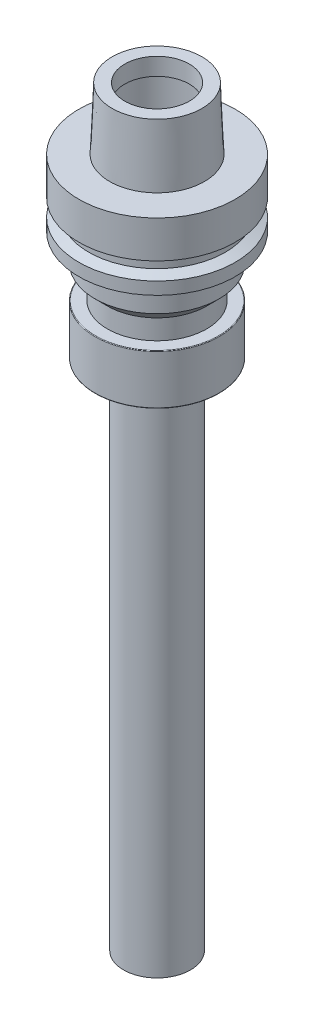
ISO-10303-21;
HEADER;
FILE_DESCRIPTION(('STEP AP214'),'2;1');
FILE_NAME('part.step','',(''),(''),'','','');
FILE_SCHEMA(('AUTOMOTIVE_DESIGN { 1 0 10303 214 1 1 1 1 }'));
ENDSEC;
DATA;
#1=APPLICATION_CONTEXT('core data for automotive mechanical design processes');
#2=APPLICATION_PROTOCOL_DEFINITION('international standard','automotive_design',2000,#1);
#3=PRODUCT_CONTEXT('',#1,'mechanical');
#4=PRODUCT('Part','Part','',(#3));
#5=PRODUCT_RELATED_PRODUCT_CATEGORY('part','',(#4));
#6=PRODUCT_DEFINITION_FORMATION('','',#4);
#7=PRODUCT_DEFINITION_CONTEXT('part definition',#1,'design');
#8=PRODUCT_DEFINITION('design','',#6,#7);
#9=PRODUCT_DEFINITION_SHAPE('','',#8);
#10=(LENGTH_UNIT() NAMED_UNIT(*) SI_UNIT(.MILLI.,.METRE.));
#11=(NAMED_UNIT(*) PLANE_ANGLE_UNIT() SI_UNIT($,.RADIAN.));
#12=(NAMED_UNIT(*) SI_UNIT($,.STERADIAN.) SOLID_ANGLE_UNIT());
#13=UNCERTAINTY_MEASURE_WITH_UNIT(LENGTH_MEASURE(1.E-05),#10,'distance_accuracy_value','');
#14=(GEOMETRIC_REPRESENTATION_CONTEXT(3) GLOBAL_UNCERTAINTY_ASSIGNED_CONTEXT((#13)) GLOBAL_UNIT_ASSIGNED_CONTEXT((#10,
#11,#12)) REPRESENTATION_CONTEXT('',''));
#15=CARTESIAN_POINT('',(0.,0.,0.));
#16=DIRECTION('',(0.,0.,1.));
#17=DIRECTION('',(1.,0.,0.));
#18=AXIS2_PLACEMENT_3D('',#15,#16,#17);
#19=CARTESIAN_POINT('',(-13.,64.2999999999999,0.));
#20=DIRECTION('',(0.,-1.,0.));
#21=DIRECTION('',(0.,0.,-1.));
#22=AXIS2_PLACEMENT_3D('',#19,#20,#21);
#23=PLANE('',#22);
#24=CARTESIAN_POINT('',(0.,64.2999999999999,0.));
#25=DIRECTION('',(0.,-1.,0.));
#26=DIRECTION('',(0.,0.,-1.));
#27=AXIS2_PLACEMENT_3D('',#24,#25,#26);
#28=CIRCLE('',#27,13.);
#29=CARTESIAN_POINT('',(0.,64.2999999999999,-13.));
#30=VERTEX_POINT('',#29);
#31=EDGE_CURVE('E47',#30,#30,#28,.T.);
#32=ORIENTED_EDGE('',*,*,#31,.F.);
#33=EDGE_LOOP('',(#32));
#34=FACE_BOUND('',#33,.T.);
#35=ADVANCED_FACE('F39',(#34),#23,.F.);
#36=CARTESIAN_POINT('',(0.,0.,0.));
#37=DIRECTION('',(0.,-1.,0.));
#38=DIRECTION('',(0.,0.,-1.));
#39=AXIS2_PLACEMENT_3D('',#36,#37,#38);
#40=CYLINDRICAL_SURFACE('',#39,13.);
#41=CARTESIAN_POINT('',(0.,69.2999999999999,0.));
#42=DIRECTION('',(0.,-1.,0.));
#43=DIRECTION('',(0.,0.,-1.));
#44=AXIS2_PLACEMENT_3D('',#41,#42,#43);
#45=CIRCLE('',#44,13.);
#46=CARTESIAN_POINT('',(0.,69.2999999999999,-13.));
#47=VERTEX_POINT('',#46);
#48=EDGE_CURVE('E52',#47,#47,#45,.T.);
#49=ORIENTED_EDGE('',*,*,#48,.F.);
#50=EDGE_LOOP('',(#49));
#51=FACE_BOUND('',#50,.T.);
#52=ORIENTED_EDGE('',*,*,#31,.T.);
#53=EDGE_LOOP('',(#52));
#54=FACE_BOUND('',#53,.T.);
#55=ADVANCED_FACE('F174',(#51,#54),#40,.F.);
#56=CARTESIAN_POINT('',(-14.,69.2999999999999,0.));
#57=DIRECTION('',(0.,-1.,0.));
#58=DIRECTION('',(0.,0.,-1.));
#59=AXIS2_PLACEMENT_3D('',#56,#57,#58);
#60=PLANE('',#59);
#61=CARTESIAN_POINT('',(0.,69.2999999999999,0.));
#62=DIRECTION('',(0.,-1.,0.));
#63=DIRECTION('',(0.,0.,-1.));
#64=AXIS2_PLACEMENT_3D('',#61,#62,#63);
#65=CIRCLE('',#64,14.);
#66=CARTESIAN_POINT('',(0.,69.2999999999999,-14.));
#67=VERTEX_POINT('',#66);
#68=EDGE_CURVE('E57',#67,#67,#65,.T.);
#69=ORIENTED_EDGE('',*,*,#68,.F.);
#70=EDGE_LOOP('',(#69));
#71=FACE_BOUND('',#70,.T.);
#72=ORIENTED_EDGE('',*,*,#48,.T.);
#73=EDGE_LOOP('',(#72));
#74=FACE_BOUND('',#73,.T.);
#75=ADVANCED_FACE('F180',(#71,#74),#60,.F.);
#76=CARTESIAN_POINT('',(0.,71.2999999999999,0.));
#77=DIRECTION('',(0.,-1.,0.));
#78=DIRECTION('',(0.,0.,-1.));
#79=AXIS2_PLACEMENT_3D('',#76,#77,#78);
#80=TOROIDAL_SURFACE('',#79,14.,2.);
#81=CARTESIAN_POINT('',(0.,71.2999999999999,0.));
#82=DIRECTION('',(0.,-1.,0.));
#83=DIRECTION('',(0.,0.,-1.));
#84=AXIS2_PLACEMENT_3D('',#81,#82,#83);
#85=CIRCLE('',#84,16.);
#86=CARTESIAN_POINT('',(0.,71.2999999999999,-16.));
#87=VERTEX_POINT('',#86);
#88=EDGE_CURVE('E63',#87,#87,#85,.T.);
#89=ORIENTED_EDGE('',*,*,#88,.F.);
#90=EDGE_LOOP('',(#89));
#91=FACE_BOUND('',#90,.T.);
#92=ORIENTED_EDGE('',*,*,#68,.T.);
#93=EDGE_LOOP('',(#92));
#94=FACE_BOUND('',#93,.T.);
#95=ADVANCED_FACE('F186',(#91,#94),#80,.F.);
#96=CARTESIAN_POINT('',(0.,0.,0.));
#97=DIRECTION('',(0.,-1.,0.));
#98=DIRECTION('',(0.,0.,-1.));
#99=AXIS2_PLACEMENT_3D('',#96,#97,#98);
#100=CYLINDRICAL_SURFACE('',#99,16.);
#101=CARTESIAN_POINT('',(0.,89.2999999999999,0.));
#102=DIRECTION('',(0.,-1.,0.));
#103=DIRECTION('',(0.,0.,-1.));
#104=AXIS2_PLACEMENT_3D('',#101,#102,#103);
#105=CIRCLE('',#104,16.);
#106=CARTESIAN_POINT('',(0.,89.2999999999999,-16.));
#107=VERTEX_POINT('',#106);
#108=EDGE_CURVE('E67',#107,#107,#105,.T.);
#109=ORIENTED_EDGE('',*,*,#108,.F.);
#110=EDGE_LOOP('',(#109));
#111=FACE_BOUND('',#110,.T.);
#112=ORIENTED_EDGE('',*,*,#88,.T.);
#113=EDGE_LOOP('',(#112));
#114=FACE_BOUND('',#113,.T.);
#115=ADVANCED_FACE('F190',(#111,#114),#100,.F.);
#116=CARTESIAN_POINT('',(0.,89.2999999999999,0.));
#117=DIRECTION('',(0.,-1.,0.));
#118=DIRECTION('',(0.,0.,-1.));
#119=AXIS2_PLACEMENT_3D('',#116,#117,#118);
#120=TOROIDAL_SURFACE('',#119,14.,2.);
#121=CARTESIAN_POINT('',(0.,91.2999999999999,0.));
#122=DIRECTION('',(0.,-1.,0.));
#123=DIRECTION('',(0.,0.,-1.));
#124=AXIS2_PLACEMENT_3D('',#121,#122,#123);
#125=CIRCLE('',#124,14.);
#126=CARTESIAN_POINT('',(0.,91.2999999999999,-14.));
#127=VERTEX_POINT('',#126);
#128=EDGE_CURVE('E71',#127,#127,#125,.T.);
#129=ORIENTED_EDGE('',*,*,#128,.F.);
#130=EDGE_LOOP('',(#129));
#131=FACE_BOUND('',#130,.T.);
#132=ORIENTED_EDGE('',*,*,#108,.T.);
#133=EDGE_LOOP('',(#132));
#134=FACE_BOUND('',#133,.T.);
#135=ADVANCED_FACE('F194',(#131,#134),#120,.F.);
#136=CARTESIAN_POINT('',(-13.,91.2999999999999,0.));
#137=DIRECTION('',(0.,1.,0.));
#138=DIRECTION('',(0.,0.,1.));
#139=AXIS2_PLACEMENT_3D('',#136,#137,#138);
#140=PLANE('',#139);
#141=CARTESIAN_POINT('',(0.,91.2999999999999,0.));
#142=DIRECTION('',(0.,-1.,0.));
#143=DIRECTION('',(0.,0.,-1.));
#144=AXIS2_PLACEMENT_3D('',#141,#142,#143);
#145=CIRCLE('',#144,13.);
#146=CARTESIAN_POINT('',(0.,91.2999999999999,-13.));
#147=VERTEX_POINT('',#146);
#148=EDGE_CURVE('E75',#147,#147,#145,.T.);
#149=ORIENTED_EDGE('',*,*,#148,.F.);
#150=EDGE_LOOP('',(#149));
#151=FACE_BOUND('',#150,.T.);
#152=ORIENTED_EDGE('',*,*,#128,.T.);
#153=EDGE_LOOP('',(#152));
#154=FACE_BOUND('',#153,.T.);
#155=ADVANCED_FACE('F198',(#151,#154),#140,.F.);
#156=CARTESIAN_POINT('',(0.,0.,0.));
#157=DIRECTION('',(0.,-1.,0.));
#158=DIRECTION('',(0.,0.,-1.));
#159=AXIS2_PLACEMENT_3D('',#156,#157,#158);
#160=CYLINDRICAL_SURFACE('',#159,13.);
#161=CARTESIAN_POINT('',(0.,98.2999999999999,0.));
#162=DIRECTION('',(0.,-1.,0.));
#163=DIRECTION('',(0.,0.,-1.));
#164=AXIS2_PLACEMENT_3D('',#161,#162,#163);
#165=CIRCLE('',#164,13.);
#166=CARTESIAN_POINT('',(0.,98.2999999999999,-13.));
#167=VERTEX_POINT('',#166);
#168=EDGE_CURVE('E79',#167,#167,#165,.T.);
#169=ORIENTED_EDGE('',*,*,#168,.F.);
#170=EDGE_LOOP('',(#169));
#171=FACE_BOUND('',#170,.T.);
#172=ORIENTED_EDGE('',*,*,#148,.T.);
#173=EDGE_LOOP('',(#172));
#174=FACE_BOUND('',#173,.T.);
#175=ADVANCED_FACE('F202',(#171,#174),#160,.F.);
#176=CARTESIAN_POINT('',(-13.,98.2999999999999,0.));
#177=DIRECTION('',(0.,-1.,0.));
#178=DIRECTION('',(0.,0.,-1.));
#179=AXIS2_PLACEMENT_3D('',#176,#177,#178);
#180=PLANE('',#179);
#181=CARTESIAN_POINT('',(0.,98.2999999999999,0.));
#182=DIRECTION('',(0.,-1.,0.));
#183=DIRECTION('',(0.,0.,-1.));
#184=AXIS2_PLACEMENT_3D('',#181,#182,#183);
#185=CIRCLE('',#184,18.085);
#186=CARTESIAN_POINT('',(0.,98.2999999999999,-18.085));
#187=VERTEX_POINT('',#186);
#188=EDGE_CURVE('E83',#187,#187,#185,.T.);
#189=ORIENTED_EDGE('',*,*,#188,.F.);
#190=EDGE_LOOP('',(#189));
#191=FACE_BOUND('',#190,.T.);
#192=ORIENTED_EDGE('',*,*,#168,.T.);
#193=EDGE_LOOP('',(#192));
#194=FACE_BOUND('',#193,.T.);
#195=ADVANCED_FACE('F206',(#191,#194),#180,.F.);
#196=CARTESIAN_POINT('',(0.,98.2999999999999,0.));
#197=DIRECTION('',(0.,-1.,0.));
#198=DIRECTION('',(0.,0.,-1.));
#199=AXIS2_PLACEMENT_3D('',#196,#197,#198);
#200=CONICAL_SURFACE('',#199,18.085,0.0405777142314997);
#201=CARTESIAN_POINT('',(0.,73.2999999999999,0.));
#202=DIRECTION('',(0.,-1.,0.));
#203=DIRECTION('',(0.,0.,-1.));
#204=AXIS2_PLACEMENT_3D('',#201,#202,#203);
#205=CIRCLE('',#204,19.1);
#206=CARTESIAN_POINT('',(0.,73.2999999999999,-19.1));
#207=VERTEX_POINT('',#206);
#208=EDGE_CURVE('E87',#207,#207,#205,.T.);
#209=ORIENTED_EDGE('',*,*,#208,.F.);
#210=EDGE_LOOP('',(#209));
#211=FACE_BOUND('',#210,.T.);
#212=ORIENTED_EDGE('',*,*,#188,.T.);
#213=EDGE_LOOP('',(#212));
#214=FACE_BOUND('',#213,.T.);
#215=ADVANCED_FACE('F210',(#211,#214),#200,.T.);
#216=CARTESIAN_POINT('',(-19.1,73.2999999999999,0.));
#217=DIRECTION('',(0.,-1.,0.));
#218=DIRECTION('',(0.,0.,-1.));
#219=AXIS2_PLACEMENT_3D('',#216,#217,#218);
#220=PLANE('',#219);
#221=CARTESIAN_POINT('',(0.,73.2999999999999,0.));
#222=DIRECTION('',(0.,-1.,0.));
#223=DIRECTION('',(0.,0.,-1.));
#224=AXIS2_PLACEMENT_3D('',#221,#222,#223);
#225=CIRCLE('',#224,31.5);
#226=CARTESIAN_POINT('',(0.,73.2999999999999,-31.5));
#227=VERTEX_POINT('',#226);
#228=EDGE_CURVE('E91',#227,#227,#225,.T.);
#229=ORIENTED_EDGE('',*,*,#228,.F.);
#230=EDGE_LOOP('',(#229));
#231=FACE_BOUND('',#230,.T.);
#232=ORIENTED_EDGE('',*,*,#208,.T.);
#233=EDGE_LOOP('',(#232));
#234=FACE_BOUND('',#233,.T.);
#235=ADVANCED_FACE('F214',(#231,#234),#220,.F.);
#236=CARTESIAN_POINT('',(0.,0.,0.));
#237=DIRECTION('',(0.,-1.,0.));
#238=DIRECTION('',(0.,0.,-1.));
#239=AXIS2_PLACEMENT_3D('',#236,#237,#238);
#240=CYLINDRICAL_SURFACE('',#239,31.5);
#241=CARTESIAN_POINT('',(0.,58.2999999999999,0.));
#242=DIRECTION('',(0.,-1.,0.));
#243=DIRECTION('',(0.,0.,-1.));
#244=AXIS2_PLACEMENT_3D('',#241,#242,#243);
#245=CIRCLE('',#244,31.5);
#246=CARTESIAN_POINT('',(0.,58.2999999999999,-31.5));
#247=VERTEX_POINT('',#246);
#248=EDGE_CURVE('E95',#247,#247,#245,.T.);
#249=ORIENTED_EDGE('',*,*,#248,.F.);
#250=EDGE_LOOP('',(#249));
#251=FACE_BOUND('',#250,.T.);
#252=ORIENTED_EDGE('',*,*,#228,.T.);
#253=EDGE_LOOP('',(#252));
#254=FACE_BOUND('',#253,.T.);
#255=ADVANCED_FACE('F218',(#251,#254),#240,.T.);
#256=CARTESIAN_POINT('',(0.,58.2999999999999,0.));
#257=DIRECTION('',(0.,1.,0.));
#258=DIRECTION('',(0.,0.,1.));
#259=AXIS2_PLACEMENT_3D('',#256,#257,#258);
#260=CONICAL_SURFACE('',#259,31.5,1.21202565652432);
#261=CARTESIAN_POINT('',(0.,56.7999999999999,0.));
#262=DIRECTION('',(0.,-1.,0.));
#263=DIRECTION('',(0.,0.,-1.));
#264=AXIS2_PLACEMENT_3D('',#261,#262,#263);
#265=CIRCLE('',#264,27.5);
#266=CARTESIAN_POINT('',(0.,56.7999999999999,-27.5));
#267=VERTEX_POINT('',#266);
#268=EDGE_CURVE('E99',#267,#267,#265,.T.);
#269=ORIENTED_EDGE('',*,*,#268,.F.);
#270=EDGE_LOOP('',(#269));
#271=FACE_BOUND('',#270,.T.);
#272=ORIENTED_EDGE('',*,*,#248,.T.);
#273=EDGE_LOOP('',(#272));
#274=FACE_BOUND('',#273,.T.);
#275=ADVANCED_FACE('F222',(#271,#274),#260,.T.);
#276=CARTESIAN_POINT('',(0.,0.,0.));
#277=DIRECTION('',(0.,-1.,0.));
#278=DIRECTION('',(0.,0.,-1.));
#279=AXIS2_PLACEMENT_3D('',#276,#277,#278);
#280=CYLINDRICAL_SURFACE('',#279,27.5);
#281=CARTESIAN_POINT('',(0.,52.7999999999999,0.));
#282=DIRECTION('',(0.,-1.,0.));
#283=DIRECTION('',(0.,0.,-1.));
#284=AXIS2_PLACEMENT_3D('',#281,#282,#283);
#285=CIRCLE('',#284,27.5);
#286=CARTESIAN_POINT('',(0.,52.7999999999999,-27.5));
#287=VERTEX_POINT('',#286);
#288=EDGE_CURVE('E103',#287,#287,#285,.T.);
#289=ORIENTED_EDGE('',*,*,#288,.F.);
#290=EDGE_LOOP('',(#289));
#291=FACE_BOUND('',#290,.T.);
#292=ORIENTED_EDGE('',*,*,#268,.T.);
#293=EDGE_LOOP('',(#292));
#294=FACE_BOUND('',#293,.T.);
#295=ADVANCED_FACE('F226',(#291,#294),#280,.T.);
#296=CARTESIAN_POINT('',(0.,52.7999999999999,0.));
#297=DIRECTION('',(0.,-1.,0.));
#298=DIRECTION('',(0.,0.,-1.));
#299=AXIS2_PLACEMENT_3D('',#296,#297,#298);
#300=CONICAL_SURFACE('',#299,27.5,1.21202565652435);
#301=CARTESIAN_POINT('',(0.,51.3,0.));
#302=DIRECTION('',(0.,-1.,0.));
#303=DIRECTION('',(0.,0.,-1.));
#304=AXIS2_PLACEMENT_3D('',#301,#302,#303);
#305=CIRCLE('',#304,31.5);
#306=CARTESIAN_POINT('',(0.,51.3,-31.5));
#307=VERTEX_POINT('',#306);
#308=EDGE_CURVE('E107',#307,#307,#305,.T.);
#309=ORIENTED_EDGE('',*,*,#308,.F.);
#310=EDGE_LOOP('',(#309));
#311=FACE_BOUND('',#310,.T.);
#312=ORIENTED_EDGE('',*,*,#288,.T.);
#313=EDGE_LOOP('',(#312));
#314=FACE_BOUND('',#313,.T.);
#315=ADVANCED_FACE('F230',(#311,#314),#300,.T.);
#316=CARTESIAN_POINT('',(0.,0.,0.));
#317=DIRECTION('',(0.,-1.,0.));
#318=DIRECTION('',(0.,0.,-1.));
#319=AXIS2_PLACEMENT_3D('',#316,#317,#318);
#320=CYLINDRICAL_SURFACE('',#319,31.5);
#321=CARTESIAN_POINT('',(0.,46.3,0.));
#322=DIRECTION('',(0.,-1.,0.));
#323=DIRECTION('',(0.,0.,-1.));
#324=AXIS2_PLACEMENT_3D('',#321,#322,#323);
#325=CIRCLE('',#324,31.5);
#326=CARTESIAN_POINT('',(0.,46.3,-31.5));
#327=VERTEX_POINT('',#326);
#328=EDGE_CURVE('E111',#327,#327,#325,.T.);
#329=ORIENTED_EDGE('',*,*,#328,.F.);
#330=EDGE_LOOP('',(#329));
#331=FACE_BOUND('',#330,.T.);
#332=ORIENTED_EDGE('',*,*,#308,.T.);
#333=EDGE_LOOP('',(#332));
#334=FACE_BOUND('',#333,.T.);
#335=ADVANCED_FACE('F234',(#331,#334),#320,.T.);
#336=CARTESIAN_POINT('',(-31.5,46.3,0.));
#337=DIRECTION('',(0.,1.,0.));
#338=DIRECTION('',(0.,0.,1.));
#339=AXIS2_PLACEMENT_3D('',#336,#337,#338);
#340=PLANE('',#339);
#341=CARTESIAN_POINT('',(0.,46.3,0.));
#342=DIRECTION('',(0.,-1.,0.));
#343=DIRECTION('',(0.,0.,-1.));
#344=AXIS2_PLACEMENT_3D('',#341,#342,#343);
#345=CIRCLE('',#344,25.);
#346=CARTESIAN_POINT('',(0.,46.3,-25.));
#347=VERTEX_POINT('',#346);
#348=EDGE_CURVE('E115',#347,#347,#345,.T.);
#349=ORIENTED_EDGE('',*,*,#348,.F.);
#350=EDGE_LOOP('',(#349));
#351=FACE_BOUND('',#350,.T.);
#352=ORIENTED_EDGE('',*,*,#328,.T.);
#353=EDGE_LOOP('',(#352));
#354=FACE_BOUND('',#353,.T.);
#355=ADVANCED_FACE('F238',(#351,#354),#340,.F.);
#356=CARTESIAN_POINT('',(0.,0.,0.));
#357=DIRECTION('',(0.,-1.,0.));
#358=DIRECTION('',(0.,0.,-1.));
#359=AXIS2_PLACEMENT_3D('',#356,#357,#358);
#360=CYLINDRICAL_SURFACE('',#359,25.);
#361=CARTESIAN_POINT('',(0.,35.3,0.));
#362=DIRECTION('',(0.,-1.,0.));
#363=DIRECTION('',(0.,0.,-1.));
#364=AXIS2_PLACEMENT_3D('',#361,#362,#363);
#365=CIRCLE('',#364,25.);
#366=CARTESIAN_POINT('',(0.,35.3,-25.));
#367=VERTEX_POINT('',#366);
#368=EDGE_CURVE('E119',#367,#367,#365,.T.);
#369=ORIENTED_EDGE('',*,*,#368,.F.);
#370=EDGE_LOOP('',(#369));
#371=FACE_BOUND('',#370,.T.);
#372=ORIENTED_EDGE('',*,*,#348,.T.);
#373=EDGE_LOOP('',(#372));
#374=FACE_BOUND('',#373,.T.);
#375=ADVANCED_FACE('F242',(#371,#374),#360,.T.);
#376=CARTESIAN_POINT('',(0.,35.3,0.));
#377=DIRECTION('',(0.,1.,0.));
#378=DIRECTION('',(0.,0.,1.));
#379=AXIS2_PLACEMENT_3D('',#376,#377,#378);
#380=CONICAL_SURFACE('',#379,25.,0.785398163397451);
#381=CARTESIAN_POINT('',(0.,30.3,0.));
#382=DIRECTION('',(0.,-1.,0.));
#383=DIRECTION('',(0.,0.,-1.));
#384=AXIS2_PLACEMENT_3D('',#381,#382,#383);
#385=CIRCLE('',#384,20.);
#386=CARTESIAN_POINT('',(0.,30.3,-20.));
#387=VERTEX_POINT('',#386);
#388=EDGE_CURVE('E123',#387,#387,#385,.T.);
#389=ORIENTED_EDGE('',*,*,#388,.F.);
#390=EDGE_LOOP('',(#389));
#391=FACE_BOUND('',#390,.T.);
#392=ORIENTED_EDGE('',*,*,#368,.T.);
#393=EDGE_LOOP('',(#392));
#394=FACE_BOUND('',#393,.T.);
#395=ADVANCED_FACE('F246',(#391,#394),#380,.T.);
#396=CARTESIAN_POINT('',(0.,0.,0.));
#397=DIRECTION('',(0.,-1.,0.));
#398=DIRECTION('',(0.,0.,-1.));
#399=AXIS2_PLACEMENT_3D('',#396,#397,#398);
#400=CYLINDRICAL_SURFACE('',#399,20.);
#401=CARTESIAN_POINT('',(0.,22.3,0.));
#402=DIRECTION('',(0.,-1.,0.));
#403=DIRECTION('',(0.,0.,-1.));
#404=AXIS2_PLACEMENT_3D('',#401,#402,#403);
#405=CIRCLE('',#404,20.);
#406=CARTESIAN_POINT('',(0.,22.3,-20.));
#407=VERTEX_POINT('',#406);
#408=EDGE_CURVE('E127',#407,#407,#405,.T.);
#409=ORIENTED_EDGE('',*,*,#408,.F.);
#410=EDGE_LOOP('',(#409));
#411=FACE_BOUND('',#410,.T.);
#412=ORIENTED_EDGE('',*,*,#388,.T.);
#413=EDGE_LOOP('',(#412));
#414=FACE_BOUND('',#413,.T.);
#415=ADVANCED_FACE('F250',(#411,#414),#400,.T.);
#416=CARTESIAN_POINT('',(-20.,22.3,0.));
#417=DIRECTION('',(0.,-1.,0.));
#418=DIRECTION('',(0.,0.,-1.));
#419=AXIS2_PLACEMENT_3D('',#416,#417,#418);
#420=PLANE('',#419);
#421=CARTESIAN_POINT('',(0.,22.3,0.));
#422=DIRECTION('',(0.,-1.,0.));
#423=DIRECTION('',(0.,0.,-1.));
#424=AXIS2_PLACEMENT_3D('',#421,#422,#423);
#425=CIRCLE('',#424,24.75);
#426=CARTESIAN_POINT('',(0.,22.3,-24.75));
#427=VERTEX_POINT('',#426);
#428=EDGE_CURVE('E131',#427,#427,#425,.T.);
#429=ORIENTED_EDGE('',*,*,#428,.F.);
#430=EDGE_LOOP('',(#429));
#431=FACE_BOUND('',#430,.T.);
#432=ORIENTED_EDGE('',*,*,#408,.T.);
#433=EDGE_LOOP('',(#432));
#434=FACE_BOUND('',#433,.T.);
#435=ADVANCED_FACE('F254',(#431,#434),#420,.F.);
#436=CARTESIAN_POINT('',(0.,22.05,0.));
#437=DIRECTION('',(0.,-1.,0.));
#438=DIRECTION('',(0.,0.,-1.));
#439=AXIS2_PLACEMENT_3D('',#436,#437,#438);
#440=TOROIDAL_SURFACE('',#439,24.75,0.25);
#441=CARTESIAN_POINT('',(0.,22.05,0.));
#442=DIRECTION('',(0.,-1.,0.));
#443=DIRECTION('',(0.,0.,-1.));
#444=AXIS2_PLACEMENT_3D('',#441,#442,#443);
#445=CIRCLE('',#444,25.);
#446=CARTESIAN_POINT('',(0.,22.05,-25.));
#447=VERTEX_POINT('',#446);
#448=EDGE_CURVE('E135',#447,#447,#445,.T.);
#449=ORIENTED_EDGE('',*,*,#448,.F.);
#450=EDGE_LOOP('',(#449));
#451=FACE_BOUND('',#450,.T.);
#452=ORIENTED_EDGE('',*,*,#428,.T.);
#453=EDGE_LOOP('',(#452));
#454=FACE_BOUND('',#453,.T.);
#455=ADVANCED_FACE('F258',(#451,#454),#440,.T.);
#456=CARTESIAN_POINT('',(0.,0.,0.));
#457=DIRECTION('',(0.,-1.,0.));
#458=DIRECTION('',(0.,0.,-1.));
#459=AXIS2_PLACEMENT_3D('',#456,#457,#458);
#460=CYLINDRICAL_SURFACE('',#459,25.);
#461=CARTESIAN_POINT('',(0.,2.44433756729741,0.));
#462=DIRECTION('',(0.,-1.,0.));
#463=DIRECTION('',(0.,0.,-1.));
#464=AXIS2_PLACEMENT_3D('',#461,#462,#463);
#465=CIRCLE('',#464,25.);
#466=CARTESIAN_POINT('',(0.,2.44433756729741,-25.));
#467=VERTEX_POINT('',#466);
#468=EDGE_CURVE('E139',#467,#467,#465,.T.);
#469=ORIENTED_EDGE('',*,*,#468,.F.);
#470=EDGE_LOOP('',(#469));
#471=FACE_BOUND('',#470,.T.);
#472=ORIENTED_EDGE('',*,*,#448,.T.);
#473=EDGE_LOOP('',(#472));
#474=FACE_BOUND('',#473,.T.);
#475=ADVANCED_FACE('F262',(#471,#474),#460,.T.);
#476=CARTESIAN_POINT('',(0.,2.44433756729741,0.));
#477=DIRECTION('',(0.,-1.,0.));
#478=DIRECTION('',(0.,0.,-1.));
#479=AXIS2_PLACEMENT_3D('',#476,#477,#478);
#480=TOROIDAL_SURFACE('',#479,24.75,0.25);
#481=CARTESIAN_POINT('',(0.,2.2278312163513,0.));
#482=DIRECTION('',(0.,-1.,0.));
#483=DIRECTION('',(0.,0.,-1.));
#484=AXIS2_PLACEMENT_3D('',#481,#482,#483);
#485=CIRCLE('',#484,24.875);
#486=CARTESIAN_POINT('',(0.,2.2278312163513,-24.875));
#487=VERTEX_POINT('',#486);
#488=EDGE_CURVE('E143',#487,#487,#485,.T.);
#489=ORIENTED_EDGE('',*,*,#488,.F.);
#490=EDGE_LOOP('',(#489));
#491=FACE_BOUND('',#490,.T.);
#492=ORIENTED_EDGE('',*,*,#468,.T.);
#493=EDGE_LOOP('',(#492));
#494=FACE_BOUND('',#493,.T.);
#495=ADVANCED_FACE('F266',(#491,#494),#480,.T.);
#496=CARTESIAN_POINT('',(0.,2.2278312163513,0.));
#497=DIRECTION('',(0.,1.,0.));
#498=DIRECTION('',(0.,0.,1.));
#499=AXIS2_PLACEMENT_3D('',#496,#497,#498);
#500=CONICAL_SURFACE('',#499,24.875,1.0471975511966);
#501=CARTESIAN_POINT('',(0.,-0.2,0.));
#502=DIRECTION('',(0.,-1.,0.));
#503=DIRECTION('',(0.,0.,-1.));
#504=AXIS2_PLACEMENT_3D('',#501,#502,#503);
#505=CIRCLE('',#504,20.6698729810778);
#506=CARTESIAN_POINT('',(0.,-0.2,-20.6698729810778));
#507=VERTEX_POINT('',#506);
#508=EDGE_CURVE('E147',#507,#507,#505,.T.);
#509=ORIENTED_EDGE('',*,*,#508,.F.);
#510=EDGE_LOOP('',(#509));
#511=FACE_BOUND('',#510,.T.);
#512=ORIENTED_EDGE('',*,*,#488,.T.);
#513=EDGE_LOOP('',(#512));
#514=FACE_BOUND('',#513,.T.);
#515=ADVANCED_FACE('F270',(#511,#514),#500,.T.);
#516=CARTESIAN_POINT('',(-20.6698729810778,-0.200000000000001,0.));
#517=DIRECTION('',(0.,1.,0.));
#518=DIRECTION('',(0.,0.,1.));
#519=AXIS2_PLACEMENT_3D('',#516,#517,#518);
#520=PLANE('',#519);
#521=CARTESIAN_POINT('',(0.,-0.200000000000001,0.));
#522=DIRECTION('',(0.,-1.,0.));
#523=DIRECTION('',(0.,0.,-1.));
#524=AXIS2_PLACEMENT_3D('',#521,#522,#523);
#525=CIRCLE('',#524,13.5);
#526=CARTESIAN_POINT('',(0.,-0.200000000000001,-13.5));
#527=VERTEX_POINT('',#526);
#528=EDGE_CURVE('E151',#527,#527,#525,.T.);
#529=ORIENTED_EDGE('',*,*,#528,.F.);
#530=EDGE_LOOP('',(#529));
#531=FACE_BOUND('',#530,.T.);
#532=ORIENTED_EDGE('',*,*,#508,.T.);
#533=EDGE_LOOP('',(#532));
#534=FACE_BOUND('',#533,.T.);
#535=ADVANCED_FACE('F274',(#531,#534),#520,.F.);
#536=CARTESIAN_POINT('',(0.,0.,0.));
#537=DIRECTION('',(0.,-1.,0.));
#538=DIRECTION('',(0.,0.,-1.));
#539=AXIS2_PLACEMENT_3D('',#536,#537,#538);
#540=CYLINDRICAL_SURFACE('',#539,13.5);
#541=CARTESIAN_POINT('',(0.,-204.68052275,0.));
#542=DIRECTION('',(0.,-1.,0.));
#543=DIRECTION('',(0.,0.,-1.));
#544=AXIS2_PLACEMENT_3D('',#541,#542,#543);
#545=CIRCLE('',#544,13.5);
#546=CARTESIAN_POINT('',(0.,-204.68052275,-13.5));
#547=VERTEX_POINT('',#546);
#548=EDGE_CURVE('E156',#547,#547,#545,.T.);
#549=ORIENTED_EDGE('',*,*,#548,.F.);
#550=EDGE_LOOP('',(#549));
#551=FACE_BOUND('',#550,.T.);
#552=ORIENTED_EDGE('',*,*,#528,.T.);
#553=EDGE_LOOP('',(#552));
#554=FACE_BOUND('',#553,.T.);
#555=ADVANCED_FACE('F278',(#551,#554),#540,.T.);
#556=CARTESIAN_POINT('',(0.,-204.68052275,0.));
#557=DIRECTION('',(0.,-1.,0.));
#558=DIRECTION('',(0.,0.,-1.));
#559=AXIS2_PLACEMENT_3D('',#556,#557,#558);
#560=PLANE('',#559);
#561=CARTESIAN_POINT('',(0.,-204.68052275,0.));
#562=DIRECTION('',(0.,-1.,0.));
#563=DIRECTION('',(0.,0.,-1.));
#564=AXIS2_PLACEMENT_3D('',#561,#562,#563);
#565=CIRCLE('',#564,2.5);
#566=CARTESIAN_POINT('',(0.,-204.68052275,-2.50000000000003));
#567=VERTEX_POINT('',#566);
#568=EDGE_CURVE('E155',#567,#567,#565,.F.);
#569=ORIENTED_EDGE('',*,*,#568,.T.);
#570=EDGE_LOOP('',(#569));
#571=FACE_BOUND('',#570,.T.);
#572=ORIENTED_EDGE('',*,*,#548,.T.);
#573=EDGE_LOOP('',(#572));
#574=FACE_BOUND('',#573,.T.);
#575=ADVANCED_FACE('F164',(#571,#574),#560,.T.);
#576=CARTESIAN_POINT('',(-2.5,15.,0.));
#577=DIRECTION('',(0.,1.,0.));
#578=DIRECTION('',(0.,0.,1.));
#579=AXIS2_PLACEMENT_3D('',#576,#577,#578);
#580=PLANE('',#579);
#581=CARTESIAN_POINT('',(0.,15.,0.));
#582=DIRECTION('',(0.,-1.,0.));
#583=DIRECTION('',(0.,0.,-1.));
#584=AXIS2_PLACEMENT_3D('',#581,#582,#583);
#585=CIRCLE('',#584,2.5);
#586=CARTESIAN_POINT('',(0.,15.,-2.5));
#587=VERTEX_POINT('',#586);
#588=EDGE_CURVE('E10',#587,#587,#585,.T.);
#589=ORIENTED_EDGE('',*,*,#588,.T.);
#590=EDGE_LOOP('',(#589));
#591=FACE_BOUND('',#590,.T.);
#592=ADVANCED_FACE('F168',(#591),#580,.F.);
#593=CARTESIAN_POINT('',(0.,0.,0.));
#594=DIRECTION('',(0.,-1.,0.));
#595=DIRECTION('',(0.,0.,-1.));
#596=AXIS2_PLACEMENT_3D('',#593,#594,#595);
#597=CYLINDRICAL_SURFACE('',#596,2.5);
#598=ORIENTED_EDGE('',*,*,#588,.F.);
#599=EDGE_LOOP('',(#598));
#600=FACE_BOUND('',#599,.T.);
#601=ORIENTED_EDGE('',*,*,#568,.F.);
#602=EDGE_LOOP('',(#601));
#603=FACE_BOUND('',#602,.T.);
#604=ADVANCED_FACE('F41',(#600,#603),#597,.F.);
#605=CLOSED_SHELL('',(#35,#55,#75,#95,#115,#135,#155,#175,#195,#215,#235,#255,#275,#295,#315,
#335,#355,#375,#395,#415,#435,#455,#475,#495,#515,#535,#555,#575,#592,#604));
#606=MANIFOLD_SOLID_BREP('B2',#605);
#607=ADVANCED_BREP_SHAPE_REPRESENTATION('',(#18,#606),#14);
#608=SHAPE_DEFINITION_REPRESENTATION(#9,#607);
ENDSEC;
END-ISO-10303-21;
